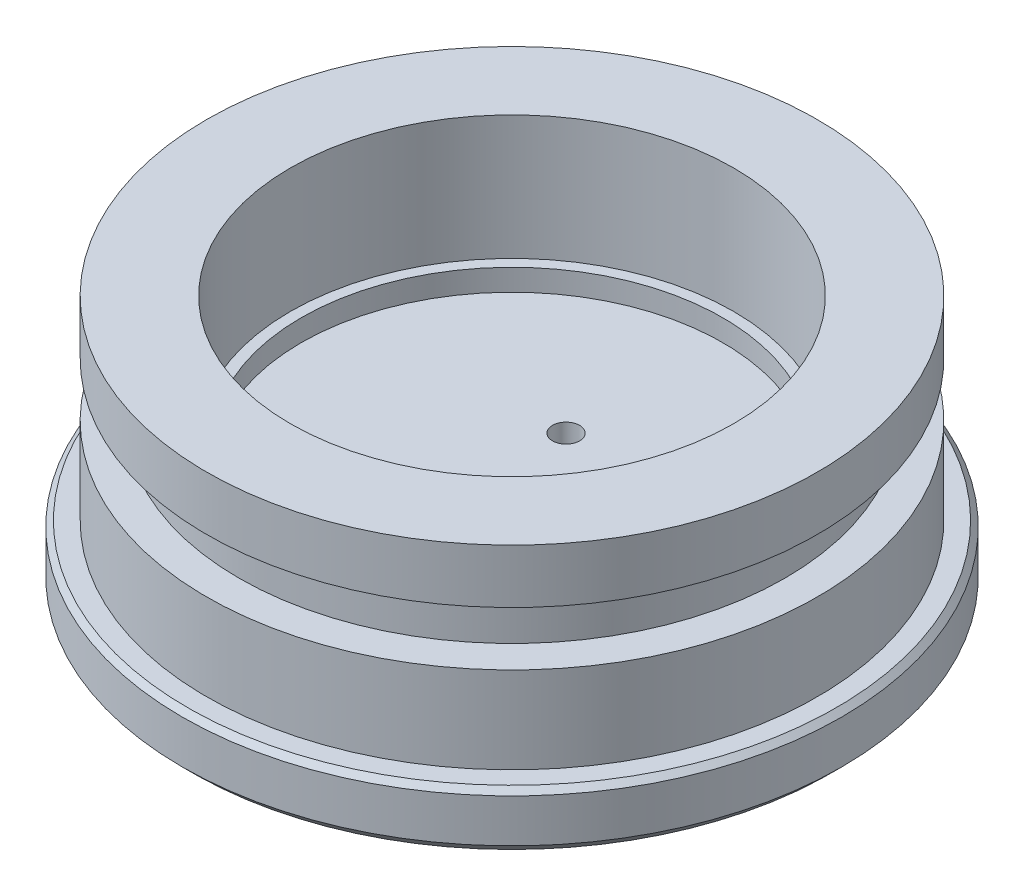
ISO-10303-21;
HEADER;
FILE_DESCRIPTION(('STEP AP214'),'2;1');
FILE_NAME('part.step','',(''),(''),'','','');
FILE_SCHEMA(('AUTOMOTIVE_DESIGN { 1 0 10303 214 1 1 1 1 }'));
ENDSEC;
DATA;
#1=APPLICATION_CONTEXT('core data for automotive mechanical design processes');
#2=APPLICATION_PROTOCOL_DEFINITION('international standard','automotive_design',2000,#1);
#3=PRODUCT_CONTEXT('',#1,'mechanical');
#4=PRODUCT('Part','Part','',(#3));
#5=PRODUCT_RELATED_PRODUCT_CATEGORY('part','',(#4));
#6=PRODUCT_DEFINITION_FORMATION('','',#4);
#7=PRODUCT_DEFINITION_CONTEXT('part definition',#1,'design');
#8=PRODUCT_DEFINITION('design','',#6,#7);
#9=PRODUCT_DEFINITION_SHAPE('','',#8);
#10=(LENGTH_UNIT() NAMED_UNIT(*) SI_UNIT(.MILLI.,.METRE.));
#11=(NAMED_UNIT(*) PLANE_ANGLE_UNIT() SI_UNIT($,.RADIAN.));
#12=(NAMED_UNIT(*) SI_UNIT($,.STERADIAN.) SOLID_ANGLE_UNIT());
#13=UNCERTAINTY_MEASURE_WITH_UNIT(LENGTH_MEASURE(1.E-05),#10,'distance_accuracy_value','');
#14=(GEOMETRIC_REPRESENTATION_CONTEXT(3) GLOBAL_UNCERTAINTY_ASSIGNED_CONTEXT((#13)) GLOBAL_UNIT_ASSIGNED_CONTEXT((#10,
#11,#12)) REPRESENTATION_CONTEXT('',''));
#15=CARTESIAN_POINT('',(0.,0.,0.));
#16=DIRECTION('',(0.,0.,1.));
#17=DIRECTION('',(1.,0.,0.));
#18=AXIS2_PLACEMENT_3D('',#15,#16,#17);
#19=CARTESIAN_POINT('',(0.,0.,0.));
#20=DIRECTION('',(0.,-1.,0.));
#21=DIRECTION('',(1.,0.,0.));
#22=AXIS2_PLACEMENT_3D('',#19,#20,#21);
#23=PLANE('',#22);
#24=CARTESIAN_POINT('',(0.,0.,0.));
#25=DIRECTION('',(0.,1.,0.));
#26=DIRECTION('',(-1.,0.,0.));
#27=AXIS2_PLACEMENT_3D('',#24,#25,#26);
#28=CIRCLE('',#27,29.5);
#29=CARTESIAN_POINT('',(-29.5,0.,0.));
#30=VERTEX_POINT('',#29);
#31=EDGE_CURVE('E11',#30,#30,#28,.T.);
#32=ORIENTED_EDGE('',*,*,#31,.F.);
#33=EDGE_LOOP('',(#32));
#34=FACE_BOUND('',#33,.T.);
#35=ADVANCED_FACE('F36',(#34),#23,.T.);
#36=CARTESIAN_POINT('',(0.,0.999999999999989,0.));
#37=DIRECTION('',(0.,1.,0.));
#38=DIRECTION('',(-1.,0.,0.));
#39=AXIS2_PLACEMENT_3D('',#36,#37,#38);
#40=CONICAL_SURFACE('',#39,30.5,0.785398163397453);
#41=ORIENTED_EDGE('',*,*,#31,.T.);
#42=EDGE_LOOP('',(#41));
#43=FACE_BOUND('',#42,.T.);
#44=CARTESIAN_POINT('',(0.,0.999999999999989,0.));
#45=DIRECTION('',(0.,1.,0.));
#46=DIRECTION('',(-1.,0.,0.));
#47=AXIS2_PLACEMENT_3D('',#44,#45,#46);
#48=CIRCLE('',#47,30.5);
#49=CARTESIAN_POINT('',(-30.5,0.999999999999989,0.));
#50=VERTEX_POINT('',#49);
#51=EDGE_CURVE('E42',#50,#50,#48,.T.);
#52=ORIENTED_EDGE('',*,*,#51,.F.);
#53=EDGE_LOOP('',(#52));
#54=FACE_BOUND('',#53,.T.);
#55=ADVANCED_FACE('F101',(#43,#54),#40,.T.);
#56=CARTESIAN_POINT('',(0.,10.,0.));
#57=DIRECTION('',(0.,1.,0.));
#58=DIRECTION('',(-1.,0.,0.));
#59=AXIS2_PLACEMENT_3D('',#56,#57,#58);
#60=CYLINDRICAL_SURFACE('',#59,30.5);
#61=ORIENTED_EDGE('',*,*,#51,.T.);
#62=EDGE_LOOP('',(#61));
#63=FACE_BOUND('',#62,.T.);
#64=CARTESIAN_POINT('',(0.,4.99999999999999,0.));
#65=DIRECTION('',(0.,1.,0.));
#66=DIRECTION('',(-1.,0.,0.));
#67=AXIS2_PLACEMENT_3D('',#64,#65,#66);
#68=CIRCLE('',#67,30.5);
#69=CARTESIAN_POINT('',(-30.5,4.99999999999999,0.));
#70=VERTEX_POINT('',#69);
#71=EDGE_CURVE('E93',#70,#70,#68,.T.);
#72=ORIENTED_EDGE('',*,*,#71,.F.);
#73=EDGE_LOOP('',(#72));
#74=FACE_BOUND('',#73,.T.);
#75=ADVANCED_FACE('F98',(#63,#74),#60,.T.);
#76=CARTESIAN_POINT('',(0.,5.49999999999999,0.));
#77=DIRECTION('',(0.,-1.,0.));
#78=DIRECTION('',(1.,0.,0.));
#79=AXIS2_PLACEMENT_3D('',#76,#77,#78);
#80=CONICAL_SURFACE('',#79,30.,0.785398163397444);
#81=ORIENTED_EDGE('',*,*,#71,.T.);
#82=EDGE_LOOP('',(#81));
#83=FACE_BOUND('',#82,.T.);
#84=CARTESIAN_POINT('',(0.,5.49999999999999,0.));
#85=DIRECTION('',(0.,1.,0.));
#86=DIRECTION('',(-1.,0.,0.));
#87=AXIS2_PLACEMENT_3D('',#84,#85,#86);
#88=CIRCLE('',#87,30.);
#89=CARTESIAN_POINT('',(-30.,5.49999999999999,0.));
#90=VERTEX_POINT('',#89);
#91=EDGE_CURVE('E90',#90,#90,#88,.T.);
#92=ORIENTED_EDGE('',*,*,#91,.F.);
#93=EDGE_LOOP('',(#92));
#94=FACE_BOUND('',#93,.T.);
#95=ADVANCED_FACE('F108',(#83,#94),#80,.T.);
#96=CARTESIAN_POINT('',(-30.,5.49999999999999,0.));
#97=DIRECTION('',(0.,1.,0.));
#98=DIRECTION('',(-1.,0.,0.));
#99=AXIS2_PLACEMENT_3D('',#96,#97,#98);
#100=PLANE('',#99);
#101=ORIENTED_EDGE('',*,*,#91,.T.);
#102=EDGE_LOOP('',(#101));
#103=FACE_BOUND('',#102,.T.);
#104=CARTESIAN_POINT('',(0.,5.49999999999999,0.));
#105=DIRECTION('',(0.,1.,0.));
#106=DIRECTION('',(-1.,0.,0.));
#107=AXIS2_PLACEMENT_3D('',#104,#105,#106);
#108=CIRCLE('',#107,28.25);
#109=CARTESIAN_POINT('',(-28.25,5.49999999999999,0.));
#110=VERTEX_POINT('',#109);
#111=EDGE_CURVE('E87',#110,#110,#108,.T.);
#112=ORIENTED_EDGE('',*,*,#111,.F.);
#113=EDGE_LOOP('',(#112));
#114=FACE_BOUND('',#113,.T.);
#115=ADVANCED_FACE('F114',(#103,#114),#100,.T.);
#116=CARTESIAN_POINT('',(0.,10.,0.));
#117=DIRECTION('',(0.,1.,0.));
#118=DIRECTION('',(-1.,0.,0.));
#119=AXIS2_PLACEMENT_3D('',#116,#117,#118);
#120=CYLINDRICAL_SURFACE('',#119,28.25);
#121=ORIENTED_EDGE('',*,*,#111,.T.);
#122=EDGE_LOOP('',(#121));
#123=FACE_BOUND('',#122,.T.);
#124=CARTESIAN_POINT('',(0.,13.5,0.));
#125=DIRECTION('',(0.,1.,0.));
#126=DIRECTION('',(-1.,0.,0.));
#127=AXIS2_PLACEMENT_3D('',#124,#125,#126);
#128=CIRCLE('',#127,28.25);
#129=CARTESIAN_POINT('',(-28.25,13.5,0.));
#130=VERTEX_POINT('',#129);
#131=EDGE_CURVE('E84',#130,#130,#128,.T.);
#132=ORIENTED_EDGE('',*,*,#131,.F.);
#133=EDGE_LOOP('',(#132));
#134=FACE_BOUND('',#133,.T.);
#135=ADVANCED_FACE('F118',(#123,#134),#120,.T.);
#136=CARTESIAN_POINT('',(-28.25,13.5,0.));
#137=DIRECTION('',(0.,1.,0.));
#138=DIRECTION('',(-1.,0.,0.));
#139=AXIS2_PLACEMENT_3D('',#136,#137,#138);
#140=PLANE('',#139);
#141=ORIENTED_EDGE('',*,*,#131,.T.);
#142=EDGE_LOOP('',(#141));
#143=FACE_BOUND('',#142,.T.);
#144=CARTESIAN_POINT('',(0.,13.5,0.));
#145=DIRECTION('',(0.,1.,0.));
#146=DIRECTION('',(-1.,0.,0.));
#147=AXIS2_PLACEMENT_3D('',#144,#145,#146);
#148=CIRCLE('',#147,25.25);
#149=CARTESIAN_POINT('',(-25.25,13.5,0.));
#150=VERTEX_POINT('',#149);
#151=EDGE_CURVE('E81',#150,#150,#148,.T.);
#152=ORIENTED_EDGE('',*,*,#151,.F.);
#153=EDGE_LOOP('',(#152));
#154=FACE_BOUND('',#153,.T.);
#155=ADVANCED_FACE('F122',(#143,#154),#140,.T.);
#156=CARTESIAN_POINT('',(0.,10.,0.));
#157=DIRECTION('',(0.,1.,0.));
#158=DIRECTION('',(-1.,0.,0.));
#159=AXIS2_PLACEMENT_3D('',#156,#157,#158);
#160=CYLINDRICAL_SURFACE('',#159,25.25);
#161=ORIENTED_EDGE('',*,*,#151,.T.);
#162=EDGE_LOOP('',(#161));
#163=FACE_BOUND('',#162,.T.);
#164=CARTESIAN_POINT('',(0.,18.5,0.));
#165=DIRECTION('',(0.,1.,0.));
#166=DIRECTION('',(-1.,0.,0.));
#167=AXIS2_PLACEMENT_3D('',#164,#165,#166);
#168=CIRCLE('',#167,25.25);
#169=CARTESIAN_POINT('',(-25.25,18.5,0.));
#170=VERTEX_POINT('',#169);
#171=EDGE_CURVE('E78',#170,#170,#168,.T.);
#172=ORIENTED_EDGE('',*,*,#171,.F.);
#173=EDGE_LOOP('',(#172));
#174=FACE_BOUND('',#173,.T.);
#175=ADVANCED_FACE('F126',(#163,#174),#160,.T.);
#176=CARTESIAN_POINT('',(-25.25,18.5,0.));
#177=DIRECTION('',(0.,-1.,0.));
#178=DIRECTION('',(1.,0.,0.));
#179=AXIS2_PLACEMENT_3D('',#176,#177,#178);
#180=PLANE('',#179);
#181=ORIENTED_EDGE('',*,*,#171,.T.);
#182=EDGE_LOOP('',(#181));
#183=FACE_BOUND('',#182,.T.);
#184=CARTESIAN_POINT('',(0.,18.5,0.));
#185=DIRECTION('',(0.,1.,0.));
#186=DIRECTION('',(-1.,0.,0.));
#187=AXIS2_PLACEMENT_3D('',#184,#185,#186);
#188=CIRCLE('',#187,28.25);
#189=CARTESIAN_POINT('',(-28.25,18.5,0.));
#190=VERTEX_POINT('',#189);
#191=EDGE_CURVE('E75',#190,#190,#188,.T.);
#192=ORIENTED_EDGE('',*,*,#191,.F.);
#193=EDGE_LOOP('',(#192));
#194=FACE_BOUND('',#193,.T.);
#195=ADVANCED_FACE('F130',(#183,#194),#180,.T.);
#196=CARTESIAN_POINT('',(0.,10.,0.));
#197=DIRECTION('',(0.,1.,0.));
#198=DIRECTION('',(-1.,0.,0.));
#199=AXIS2_PLACEMENT_3D('',#196,#197,#198);
#200=CYLINDRICAL_SURFACE('',#199,28.25);
#201=ORIENTED_EDGE('',*,*,#191,.T.);
#202=EDGE_LOOP('',(#201));
#203=FACE_BOUND('',#202,.T.);
#204=CARTESIAN_POINT('',(0.,23.5,0.));
#205=DIRECTION('',(0.,1.,0.));
#206=DIRECTION('',(-1.,0.,0.));
#207=AXIS2_PLACEMENT_3D('',#204,#205,#206);
#208=CIRCLE('',#207,28.25);
#209=CARTESIAN_POINT('',(-28.25,23.5,0.));
#210=VERTEX_POINT('',#209);
#211=EDGE_CURVE('E72',#210,#210,#208,.T.);
#212=ORIENTED_EDGE('',*,*,#211,.F.);
#213=EDGE_LOOP('',(#212));
#214=FACE_BOUND('',#213,.T.);
#215=ADVANCED_FACE('F134',(#203,#214),#200,.T.);
#216=CARTESIAN_POINT('',(-28.25,23.5,0.));
#217=DIRECTION('',(0.,1.,0.));
#218=DIRECTION('',(-1.,0.,0.));
#219=AXIS2_PLACEMENT_3D('',#216,#217,#218);
#220=PLANE('',#219);
#221=ORIENTED_EDGE('',*,*,#211,.T.);
#222=EDGE_LOOP('',(#221));
#223=FACE_BOUND('',#222,.T.);
#224=CARTESIAN_POINT('',(0.,23.5,0.));
#225=DIRECTION('',(0.,1.,0.));
#226=DIRECTION('',(-1.,0.,0.));
#227=AXIS2_PLACEMENT_3D('',#224,#225,#226);
#228=CIRCLE('',#227,20.5);
#229=CARTESIAN_POINT('',(-20.5,23.5,0.));
#230=VERTEX_POINT('',#229);
#231=EDGE_CURVE('E69',#230,#230,#228,.T.);
#232=ORIENTED_EDGE('',*,*,#231,.F.);
#233=EDGE_LOOP('',(#232));
#234=FACE_BOUND('',#233,.T.);
#235=ADVANCED_FACE('F138',(#223,#234),#220,.T.);
#236=CARTESIAN_POINT('',(0.,10.,0.));
#237=DIRECTION('',(0.,1.,0.));
#238=DIRECTION('',(-1.,0.,0.));
#239=AXIS2_PLACEMENT_3D('',#236,#237,#238);
#240=CYLINDRICAL_SURFACE('',#239,20.5);
#241=ORIENTED_EDGE('',*,*,#231,.T.);
#242=EDGE_LOOP('',(#241));
#243=FACE_BOUND('',#242,.T.);
#244=CARTESIAN_POINT('',(0.,12.,0.));
#245=DIRECTION('',(0.,1.,0.));
#246=DIRECTION('',(-1.,0.,0.));
#247=AXIS2_PLACEMENT_3D('',#244,#245,#246);
#248=CIRCLE('',#247,20.5);
#249=CARTESIAN_POINT('',(-20.5,12.,0.));
#250=VERTEX_POINT('',#249);
#251=EDGE_CURVE('E66',#250,#250,#248,.T.);
#252=ORIENTED_EDGE('',*,*,#251,.F.);
#253=EDGE_LOOP('',(#252));
#254=FACE_BOUND('',#253,.T.);
#255=ADVANCED_FACE('F142',(#243,#254),#240,.F.);
#256=CARTESIAN_POINT('',(-20.5,12.,0.));
#257=DIRECTION('',(0.,1.,0.));
#258=DIRECTION('',(-1.,0.,0.));
#259=AXIS2_PLACEMENT_3D('',#256,#257,#258);
#260=PLANE('',#259);
#261=ORIENTED_EDGE('',*,*,#251,.T.);
#262=EDGE_LOOP('',(#261));
#263=FACE_BOUND('',#262,.T.);
#264=CARTESIAN_POINT('',(0.,12.,0.));
#265=DIRECTION('',(0.,1.,0.));
#266=DIRECTION('',(-1.,0.,0.));
#267=AXIS2_PLACEMENT_3D('',#264,#265,#266);
#268=CIRCLE('',#267,19.5);
#269=CARTESIAN_POINT('',(-19.5,12.,0.));
#270=VERTEX_POINT('',#269);
#271=EDGE_CURVE('E59',#270,#270,#268,.T.);
#272=ORIENTED_EDGE('',*,*,#271,.F.);
#273=EDGE_LOOP('',(#272));
#274=FACE_BOUND('',#273,.T.);
#275=ADVANCED_FACE('F146',(#263,#274),#260,.T.);
#276=CARTESIAN_POINT('',(0.,10.,0.));
#277=DIRECTION('',(0.,1.,0.));
#278=DIRECTION('',(-1.,0.,0.));
#279=AXIS2_PLACEMENT_3D('',#276,#277,#278);
#280=CYLINDRICAL_SURFACE('',#279,19.5);
#281=ORIENTED_EDGE('',*,*,#271,.T.);
#282=EDGE_LOOP('',(#281));
#283=FACE_BOUND('',#282,.T.);
#284=CARTESIAN_POINT('',(0.,10.,0.));
#285=DIRECTION('',(0.,1.,0.));
#286=DIRECTION('',(-1.,0.,0.));
#287=AXIS2_PLACEMENT_3D('',#284,#285,#286);
#288=CIRCLE('',#287,19.5);
#289=CARTESIAN_POINT('',(-19.5,10.,0.));
#290=VERTEX_POINT('',#289);
#291=EDGE_CURVE('E55',#290,#290,#288,.T.);
#292=ORIENTED_EDGE('',*,*,#291,.F.);
#293=EDGE_LOOP('',(#292));
#294=FACE_BOUND('',#293,.T.);
#295=ADVANCED_FACE('F150',(#283,#294),#280,.F.);
#296=CARTESIAN_POINT('',(-19.5,10.,0.));
#297=DIRECTION('',(0.,1.,0.));
#298=DIRECTION('',(-1.,0.,0.));
#299=AXIS2_PLACEMENT_3D('',#296,#297,#298);
#300=PLANE('',#299);
#301=CARTESIAN_POINT('',(0.,10.,-5.));
#302=DIRECTION('',(0.,1.,0.));
#303=DIRECTION('',(0.,0.,1.));
#304=AXIS2_PLACEMENT_3D('',#301,#302,#303);
#305=CIRCLE('',#304,1.24999999999999);
#306=CARTESIAN_POINT('',(0.,10.,-3.75000000000001));
#307=VERTEX_POINT('',#306);
#308=EDGE_CURVE('E56',#307,#307,#305,.T.);
#309=ORIENTED_EDGE('',*,*,#308,.F.);
#310=EDGE_LOOP('',(#309));
#311=FACE_BOUND('',#310,.T.);
#312=ORIENTED_EDGE('',*,*,#291,.T.);
#313=EDGE_LOOP('',(#312));
#314=FACE_BOUND('',#313,.T.);
#315=ADVANCED_FACE('F49',(#311,#314),#300,.T.);
#316=CARTESIAN_POINT('',(0.,3.,-5.));
#317=DIRECTION('',(0.,1.,0.));
#318=DIRECTION('',(0.,0.,1.));
#319=AXIS2_PLACEMENT_3D('',#316,#317,#318);
#320=CONICAL_SURFACE('',#319,1.25,1.02974425867665);
#321=CARTESIAN_POINT('',(0.,2.24892422621555,-5.));
#322=VERTEX_POINT('',#321);
#323=VERTEX_LOOP('',#322);
#324=FACE_BOUND('',#323,.T.);
#325=CARTESIAN_POINT('',(0.,3.,-5.));
#326=DIRECTION('',(0.,1.,0.));
#327=DIRECTION('',(0.,0.,1.));
#328=AXIS2_PLACEMENT_3D('',#325,#326,#327);
#329=CIRCLE('',#328,1.25);
#330=CARTESIAN_POINT('',(0.,3.,-3.75));
#331=VERTEX_POINT('',#330);
#332=EDGE_CURVE('E53',#331,#331,#329,.T.);
#333=ORIENTED_EDGE('',*,*,#332,.T.);
#334=EDGE_LOOP('',(#333));
#335=FACE_BOUND('',#334,.T.);
#336=ADVANCED_FACE('F45',(#324,#335),#320,.F.);
#337=CARTESIAN_POINT('',(0.,10.,-5.));
#338=DIRECTION('',(0.,1.,0.));
#339=DIRECTION('',(0.,0.,1.));
#340=AXIS2_PLACEMENT_3D('',#337,#338,#339);
#341=CYLINDRICAL_SURFACE('',#340,1.24999999999999);
#342=ORIENTED_EDGE('',*,*,#332,.F.);
#343=EDGE_LOOP('',(#342));
#344=FACE_BOUND('',#343,.T.);
#345=ORIENTED_EDGE('',*,*,#308,.T.);
#346=EDGE_LOOP('',(#345));
#347=FACE_BOUND('',#346,.T.);
#348=ADVANCED_FACE('F48',(#344,#347),#341,.F.);
#349=CLOSED_SHELL('',(#35,#55,#75,#95,#115,#135,#155,#175,#195,#215,#235,#255,#275,#295,#315,
#336,#348));
#350=MANIFOLD_SOLID_BREP('B2',#349);
#351=ADVANCED_BREP_SHAPE_REPRESENTATION('',(#18,#350),#14);
#352=SHAPE_DEFINITION_REPRESENTATION(#9,#351);
ENDSEC;
END-ISO-10303-21;
